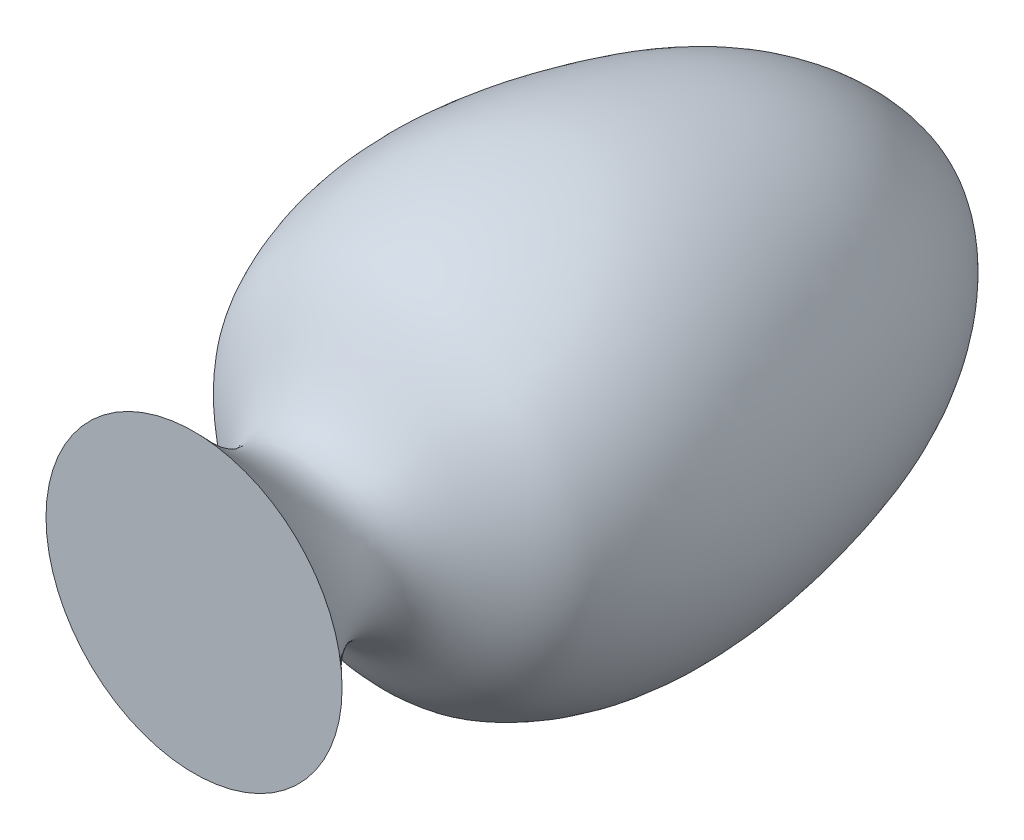
ISO-10303-21;
HEADER;
FILE_DESCRIPTION(('STEP AP214'),'2;1');
FILE_NAME('part.step','',(''),(''),'','','');
FILE_SCHEMA(('AUTOMOTIVE_DESIGN { 1 0 10303 214 1 1 1 1 }'));
ENDSEC;
DATA;
#1=APPLICATION_CONTEXT('core data for automotive mechanical design processes');
#2=APPLICATION_PROTOCOL_DEFINITION('international standard','automotive_design',2000,#1);
#3=PRODUCT_CONTEXT('',#1,'mechanical');
#4=PRODUCT('Part','Part','',(#3));
#5=PRODUCT_RELATED_PRODUCT_CATEGORY('part','',(#4));
#6=PRODUCT_DEFINITION_FORMATION('','',#4);
#7=PRODUCT_DEFINITION_CONTEXT('part definition',#1,'design');
#8=PRODUCT_DEFINITION('design','',#6,#7);
#9=PRODUCT_DEFINITION_SHAPE('','',#8);
#10=(LENGTH_UNIT() NAMED_UNIT(*) SI_UNIT(.MILLI.,.METRE.));
#11=(NAMED_UNIT(*) PLANE_ANGLE_UNIT() SI_UNIT($,.RADIAN.));
#12=(NAMED_UNIT(*) SI_UNIT($,.STERADIAN.) SOLID_ANGLE_UNIT());
#13=UNCERTAINTY_MEASURE_WITH_UNIT(LENGTH_MEASURE(1.E-05),#10,'distance_accuracy_value','');
#14=(GEOMETRIC_REPRESENTATION_CONTEXT(3) GLOBAL_UNCERTAINTY_ASSIGNED_CONTEXT((#13)) GLOBAL_UNIT_ASSIGNED_CONTEXT((#10,
#11,#12)) REPRESENTATION_CONTEXT('',''));
#15=CARTESIAN_POINT('',(0.,0.,0.));
#16=DIRECTION('',(0.,0.,1.));
#17=DIRECTION('',(1.,0.,0.));
#18=AXIS2_PLACEMENT_3D('',#15,#16,#17);
#19=CARTESIAN_POINT('',(200.,0.,1000.));
#20=DIRECTION('',(0.,0.,-1.));
#21=DIRECTION('',(-1.,0.,0.));
#22=AXIS2_PLACEMENT_3D('',#19,#20,#21);
#23=PLANE('',#22);
#24=CARTESIAN_POINT('',(1.22464679914735E-13,0.,1000.));
#25=DIRECTION('',(0.,0.,-1.));
#26=DIRECTION('',(-1.,0.,0.));
#27=AXIS2_PLACEMENT_3D('',#24,#25,#26);
#28=CIRCLE('',#27,200.);
#29=CARTESIAN_POINT('',(-200.,0.,1000.));
#30=VERTEX_POINT('',#29);
#31=EDGE_CURVE('E11',#30,#30,#28,.T.);
#32=ORIENTED_EDGE('',*,*,#31,.F.);
#33=EDGE_LOOP('',(#32));
#34=FACE_BOUND('',#33,.T.);
#35=ADVANCED_FACE('F35',(#34),#23,.F.);
#36=CARTESIAN_POINT('',(200.,0.,1000.));
#37=CARTESIAN_POINT('',(-7.40553424176069,0.,810.83939501652));
#38=CARTESIAN_POINT('',(198.797715861632,0.,815.101363260376));
#39=CARTESIAN_POINT('',(311.598393320562,0.,603.848064820168));
#40=CARTESIAN_POINT('',(294.480599989101,0.,403.735703892552));
#41=CARTESIAN_POINT('',(214.347525710833,0.,143.962732413719));
#42=CARTESIAN_POINT('',(101.557710259177,0.,26.8413838439808));
#43=CARTESIAN_POINT('',(0.,0.,0.));
#44=B_SPLINE_CURVE_WITH_KNOTS('',3,(#36,#37,#38,#39,#40,#41,#42,#43),.UNSPECIFIED.,.F.,.F.,(4,1,
1,1,1,4),(0.,0.281760857178889,0.299104370258813,0.611257444792991,0.74727688190962,1.),.UNSPECIFIED.);
#45=CARTESIAN_POINT('',(0.,0.,0.));
#46=DIRECTION('',(0.,0.,-1.));
#47=AXIS1_PLACEMENT('',#45,#46);
#48=SURFACE_OF_REVOLUTION('',#44,#47);
#49=CARTESIAN_POINT('',(0.,0.,0.));
#50=VERTEX_POINT('',#49);
#51=VERTEX_LOOP('',#50);
#52=FACE_BOUND('',#51,.T.);
#53=ORIENTED_EDGE('',*,*,#31,.T.);
#54=EDGE_LOOP('',(#53));
#55=FACE_BOUND('',#54,.T.);
#56=ADVANCED_FACE('F43',(#52,#55),#48,.T.);
#57=CLOSED_SHELL('',(#35,#56));
#58=MANIFOLD_SOLID_BREP('B2',#57);
#59=ADVANCED_BREP_SHAPE_REPRESENTATION('',(#18,#58),#14);
#60=SHAPE_DEFINITION_REPRESENTATION(#9,#59);
ENDSEC;
END-ISO-10303-21;
